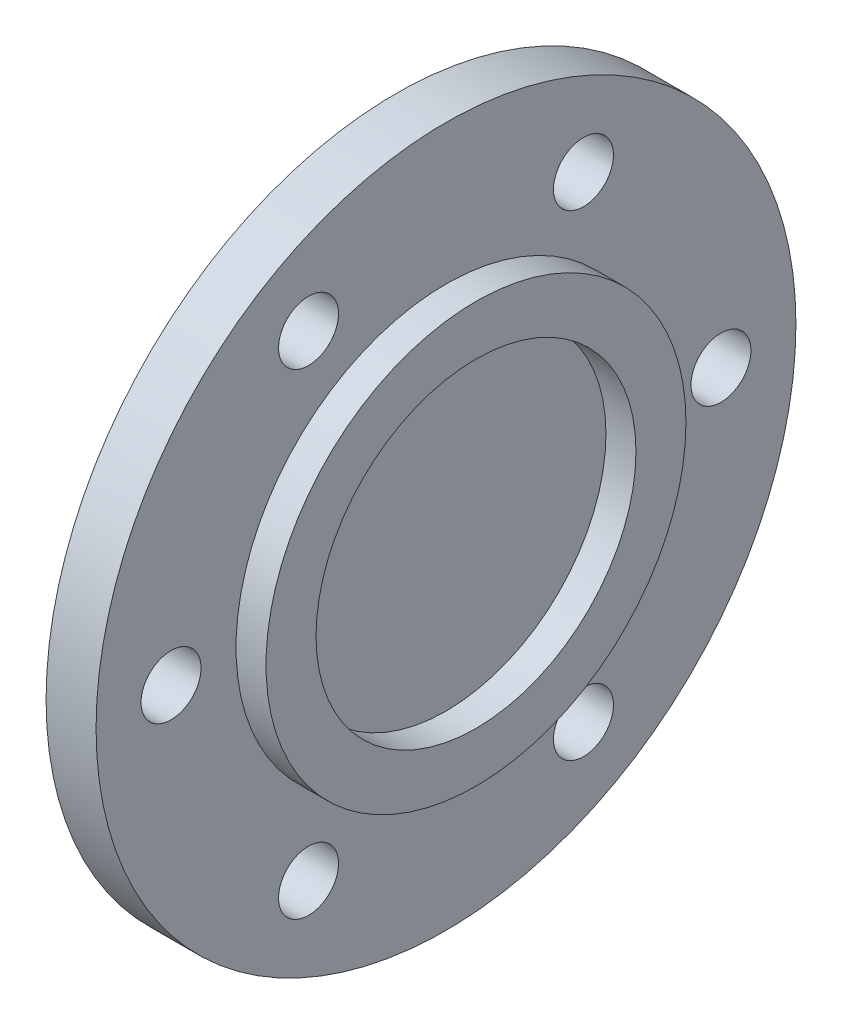
ISO-10303-21;
HEADER;
FILE_DESCRIPTION(('STEP AP214'),'2;1');
FILE_NAME('part.step','',(''),(''),'','','');
FILE_SCHEMA(('AUTOMOTIVE_DESIGN { 1 0 10303 214 1 1 1 1 }'));
ENDSEC;
DATA;
#1=APPLICATION_CONTEXT('core data for automotive mechanical design processes');
#2=APPLICATION_PROTOCOL_DEFINITION('international standard','automotive_design',2000,#1);
#3=PRODUCT_CONTEXT('',#1,'mechanical');
#4=PRODUCT('Part','Part','',(#3));
#5=PRODUCT_RELATED_PRODUCT_CATEGORY('part','',(#4));
#6=PRODUCT_DEFINITION_FORMATION('','',#4);
#7=PRODUCT_DEFINITION_CONTEXT('part definition',#1,'design');
#8=PRODUCT_DEFINITION('design','',#6,#7);
#9=PRODUCT_DEFINITION_SHAPE('','',#8);
#10=(LENGTH_UNIT() NAMED_UNIT(*) SI_UNIT(.MILLI.,.METRE.));
#11=(NAMED_UNIT(*) PLANE_ANGLE_UNIT() SI_UNIT($,.RADIAN.));
#12=(NAMED_UNIT(*) SI_UNIT($,.STERADIAN.) SOLID_ANGLE_UNIT());
#13=UNCERTAINTY_MEASURE_WITH_UNIT(LENGTH_MEASURE(1.E-05),#10,'distance_accuracy_value','');
#14=(GEOMETRIC_REPRESENTATION_CONTEXT(3) GLOBAL_UNCERTAINTY_ASSIGNED_CONTEXT((#13)) GLOBAL_UNIT_ASSIGNED_CONTEXT((#10,
#11,#12)) REPRESENTATION_CONTEXT('',''));
#15=CARTESIAN_POINT('',(0.,0.,0.));
#16=DIRECTION('',(0.,0.,1.));
#17=DIRECTION('',(1.,0.,0.));
#18=AXIS2_PLACEMENT_3D('',#15,#16,#17);
#19=CARTESIAN_POINT('',(0.,0.,0.));
#20=DIRECTION('',(-1.,0.,0.));
#21=DIRECTION('',(0.,0.,1.));
#22=AXIS2_PLACEMENT_3D('',#19,#20,#21);
#23=PLANE('',#22);
#24=CARTESIAN_POINT('',(0.,-23.8156986040719,-13.7500000000003));
#25=DIRECTION('',(-1.,0.,0.));
#26=DIRECTION('',(0.,0.,1.));
#27=AXIS2_PLACEMENT_3D('',#24,#25,#26);
#28=CIRCLE('',#27,3.);
#29=CARTESIAN_POINT('',(0.,-23.8156986040719,-10.7500000000003));
#30=VERTEX_POINT('',#29);
#31=EDGE_CURVE('E76',#30,#30,#28,.T.);
#32=ORIENTED_EDGE('',*,*,#31,.F.);
#33=EDGE_LOOP('',(#32));
#34=FACE_BOUND('',#33,.T.);
#35=CARTESIAN_POINT('',(0.,-23.8156986040722,13.7499999999998));
#36=DIRECTION('',(-1.,0.,0.));
#37=DIRECTION('',(0.,0.,1.));
#38=AXIS2_PLACEMENT_3D('',#35,#36,#37);
#39=CIRCLE('',#38,3.);
#40=CARTESIAN_POINT('',(0.,-23.8156986040722,16.7499999999998));
#41=VERTEX_POINT('',#40);
#42=EDGE_CURVE('E80',#41,#41,#39,.T.);
#43=ORIENTED_EDGE('',*,*,#42,.F.);
#44=EDGE_LOOP('',(#43));
#45=FACE_BOUND('',#44,.T.);
#46=CARTESIAN_POINT('',(0.,0.,27.5));
#47=DIRECTION('',(-1.,0.,0.));
#48=DIRECTION('',(0.,0.,1.));
#49=AXIS2_PLACEMENT_3D('',#46,#47,#48);
#50=CIRCLE('',#49,3.);
#51=CARTESIAN_POINT('',(0.,0.,30.5));
#52=VERTEX_POINT('',#51);
#53=EDGE_CURVE('E84',#52,#52,#50,.T.);
#54=ORIENTED_EDGE('',*,*,#53,.F.);
#55=EDGE_LOOP('',(#54));
#56=FACE_BOUND('',#55,.T.);
#57=CARTESIAN_POINT('',(0.,23.815698604072,13.7500000000001));
#58=DIRECTION('',(-1.,0.,0.));
#59=DIRECTION('',(0.,0.,1.));
#60=AXIS2_PLACEMENT_3D('',#57,#58,#59);
#61=CIRCLE('',#60,3.);
#62=CARTESIAN_POINT('',(0.,23.815698604072,16.7500000000001));
#63=VERTEX_POINT('',#62);
#64=EDGE_CURVE('E88',#63,#63,#61,.T.);
#65=ORIENTED_EDGE('',*,*,#64,.F.);
#66=EDGE_LOOP('',(#65));
#67=FACE_BOUND('',#66,.T.);
#68=CARTESIAN_POINT('',(0.,23.8156986040721,-13.7499999999999));
#69=DIRECTION('',(-1.,0.,0.));
#70=DIRECTION('',(0.,0.,1.));
#71=AXIS2_PLACEMENT_3D('',#68,#69,#70);
#72=CIRCLE('',#71,3.);
#73=CARTESIAN_POINT('',(0.,23.8156986040721,-10.7499999999999));
#74=VERTEX_POINT('',#73);
#75=EDGE_CURVE('E92',#74,#74,#72,.T.);
#76=ORIENTED_EDGE('',*,*,#75,.F.);
#77=EDGE_LOOP('',(#76));
#78=FACE_BOUND('',#77,.T.);
#79=CARTESIAN_POINT('',(0.,0.,-27.5));
#80=DIRECTION('',(-1.,0.,0.));
#81=DIRECTION('',(0.,0.,1.));
#82=AXIS2_PLACEMENT_3D('',#79,#80,#81);
#83=CIRCLE('',#82,3.);
#84=CARTESIAN_POINT('',(0.,0.,-24.5));
#85=VERTEX_POINT('',#84);
#86=EDGE_CURVE('E68',#85,#85,#83,.T.);
#87=ORIENTED_EDGE('',*,*,#86,.F.);
#88=EDGE_LOOP('',(#87));
#89=FACE_BOUND('',#88,.T.);
#90=CARTESIAN_POINT('',(0.,0.,0.));
#91=DIRECTION('',(1.,0.,0.));
#92=DIRECTION('',(0.,0.,-1.));
#93=AXIS2_PLACEMENT_3D('',#90,#91,#92);
#94=CIRCLE('',#93,35.);
#95=CARTESIAN_POINT('',(0.,0.,-35.));
#96=VERTEX_POINT('',#95);
#97=EDGE_CURVE('E10',#96,#96,#94,.T.);
#98=ORIENTED_EDGE('',*,*,#97,.F.);
#99=EDGE_LOOP('',(#98));
#100=FACE_BOUND('',#99,.T.);
#101=ADVANCED_FACE('F37',(#34,#45,#56,#67,#78,#89,#100),#23,.T.);
#102=CARTESIAN_POINT('',(5.,0.,0.));
#103=DIRECTION('',(1.,0.,0.));
#104=DIRECTION('',(0.,0.,-1.));
#105=AXIS2_PLACEMENT_3D('',#102,#103,#104);
#106=CYLINDRICAL_SURFACE('',#105,35.);
#107=ORIENTED_EDGE('',*,*,#97,.T.);
#108=EDGE_LOOP('',(#107));
#109=FACE_BOUND('',#108,.T.);
#110=CARTESIAN_POINT('',(5.,0.,0.));
#111=DIRECTION('',(1.,0.,0.));
#112=DIRECTION('',(0.,0.,-1.));
#113=AXIS2_PLACEMENT_3D('',#110,#111,#112);
#114=CIRCLE('',#113,35.);
#115=CARTESIAN_POINT('',(5.,0.,-35.));
#116=VERTEX_POINT('',#115);
#117=EDGE_CURVE('E44',#116,#116,#114,.T.);
#118=ORIENTED_EDGE('',*,*,#117,.F.);
#119=EDGE_LOOP('',(#118));
#120=FACE_BOUND('',#119,.T.);
#121=ADVANCED_FACE('F123',(#109,#120),#106,.T.);
#122=CARTESIAN_POINT('',(5.,35.,0.));
#123=DIRECTION('',(1.,0.,0.));
#124=DIRECTION('',(0.,0.,-1.));
#125=AXIS2_PLACEMENT_3D('',#122,#123,#124);
#126=PLANE('',#125);
#127=CARTESIAN_POINT('',(5.,-23.8156986040719,-13.7500000000003));
#128=DIRECTION('',(1.,0.,0.));
#129=DIRECTION('',(0.,-0.866025403784433,-0.50000000000001));
#130=AXIS2_PLACEMENT_3D('',#127,#128,#129);
#131=CIRCLE('',#130,3.);
#132=CARTESIAN_POINT('',(5.,-26.4137748154252,-15.2500000000003));
#133=VERTEX_POINT('',#132);
#134=EDGE_CURVE('E101',#133,#133,#131,.T.);
#135=ORIENTED_EDGE('',*,*,#134,.F.);
#136=EDGE_LOOP('',(#135));
#137=FACE_BOUND('',#136,.T.);
#138=CARTESIAN_POINT('',(5.,-23.8156986040722,13.7499999999998));
#139=DIRECTION('',(1.,0.,0.));
#140=DIRECTION('',(0.,-0.866025403784443,0.499999999999992));
#141=AXIS2_PLACEMENT_3D('',#138,#139,#140);
#142=CIRCLE('',#141,3.);
#143=CARTESIAN_POINT('',(5.,-26.4137748154255,15.2499999999998));
#144=VERTEX_POINT('',#143);
#145=EDGE_CURVE('E105',#144,#144,#142,.T.);
#146=ORIENTED_EDGE('',*,*,#145,.F.);
#147=EDGE_LOOP('',(#146));
#148=FACE_BOUND('',#147,.T.);
#149=CARTESIAN_POINT('',(5.,0.,27.5));
#150=DIRECTION('',(1.,0.,0.));
#151=DIRECTION('',(0.,0.,1.));
#152=AXIS2_PLACEMENT_3D('',#149,#150,#151);
#153=CIRCLE('',#152,3.);
#154=CARTESIAN_POINT('',(5.,0.,30.5));
#155=VERTEX_POINT('',#154);
#156=EDGE_CURVE('E109',#155,#155,#153,.T.);
#157=ORIENTED_EDGE('',*,*,#156,.F.);
#158=EDGE_LOOP('',(#157));
#159=FACE_BOUND('',#158,.T.);
#160=CARTESIAN_POINT('',(5.,23.815698604072,13.7500000000001));
#161=DIRECTION('',(1.,0.,0.));
#162=DIRECTION('',(0.,0.866025403784436,0.500000000000004));
#163=AXIS2_PLACEMENT_3D('',#160,#161,#162);
#164=CIRCLE('',#163,3.);
#165=CARTESIAN_POINT('',(5.,26.4137748154253,15.2500000000001));
#166=VERTEX_POINT('',#165);
#167=EDGE_CURVE('E100',#166,#166,#164,.T.);
#168=ORIENTED_EDGE('',*,*,#167,.F.);
#169=EDGE_LOOP('',(#168));
#170=FACE_BOUND('',#169,.T.);
#171=CARTESIAN_POINT('',(5.,23.8156986040721,-13.7499999999999));
#172=DIRECTION('',(1.,0.,0.));
#173=DIRECTION('',(0.,0.86602540378444,-0.499999999999998));
#174=AXIS2_PLACEMENT_3D('',#171,#172,#173);
#175=CIRCLE('',#174,3.);
#176=CARTESIAN_POINT('',(5.,26.4137748154254,-15.2499999999999));
#177=VERTEX_POINT('',#176);
#178=EDGE_CURVE('E96',#177,#177,#175,.T.);
#179=ORIENTED_EDGE('',*,*,#178,.F.);
#180=EDGE_LOOP('',(#179));
#181=FACE_BOUND('',#180,.T.);
#182=CARTESIAN_POINT('',(5.,0.,-27.5));
#183=DIRECTION('',(1.,0.,0.));
#184=DIRECTION('',(0.,0.,-1.));
#185=AXIS2_PLACEMENT_3D('',#182,#183,#184);
#186=CIRCLE('',#185,3.);
#187=CARTESIAN_POINT('',(5.,0.,-30.5));
#188=VERTEX_POINT('',#187);
#189=EDGE_CURVE('E72',#188,#188,#186,.T.);
#190=ORIENTED_EDGE('',*,*,#189,.F.);
#191=EDGE_LOOP('',(#190));
#192=FACE_BOUND('',#191,.T.);
#193=ORIENTED_EDGE('',*,*,#117,.T.);
#194=EDGE_LOOP('',(#193));
#195=FACE_BOUND('',#194,.T.);
#196=CARTESIAN_POINT('',(5.,0.,0.));
#197=DIRECTION('',(1.,0.,0.));
#198=DIRECTION('',(0.,0.,-1.));
#199=AXIS2_PLACEMENT_3D('',#196,#197,#198);
#200=CIRCLE('',#199,21.);
#201=CARTESIAN_POINT('',(5.,0.,-21.));
#202=VERTEX_POINT('',#201);
#203=EDGE_CURVE('E49',#202,#202,#200,.T.);
#204=ORIENTED_EDGE('',*,*,#203,.F.);
#205=EDGE_LOOP('',(#204));
#206=FACE_BOUND('',#205,.T.);
#207=ADVANCED_FACE('F119',(#137,#148,#159,#170,#181,#192,#195,#206),#126,.T.);
#208=CARTESIAN_POINT('',(5.,0.,0.));
#209=DIRECTION('',(1.,0.,0.));
#210=DIRECTION('',(0.,0.,-1.));
#211=AXIS2_PLACEMENT_3D('',#208,#209,#210);
#212=CYLINDRICAL_SURFACE('',#211,21.);
#213=ORIENTED_EDGE('',*,*,#203,.T.);
#214=EDGE_LOOP('',(#213));
#215=FACE_BOUND('',#214,.T.);
#216=CARTESIAN_POINT('',(8.,0.,0.));
#217=DIRECTION('',(1.,0.,0.));
#218=DIRECTION('',(0.,0.,-1.));
#219=AXIS2_PLACEMENT_3D('',#216,#217,#218);
#220=CIRCLE('',#219,21.);
#221=CARTESIAN_POINT('',(8.,0.,-21.));
#222=VERTEX_POINT('',#221);
#223=EDGE_CURVE('E54',#222,#222,#220,.T.);
#224=ORIENTED_EDGE('',*,*,#223,.F.);
#225=EDGE_LOOP('',(#224));
#226=FACE_BOUND('',#225,.T.);
#227=ADVANCED_FACE('F122',(#215,#226),#212,.T.);
#228=CARTESIAN_POINT('',(8.,21.,0.));
#229=DIRECTION('',(1.,0.,0.));
#230=DIRECTION('',(0.,0.,-1.));
#231=AXIS2_PLACEMENT_3D('',#228,#229,#230);
#232=PLANE('',#231);
#233=ORIENTED_EDGE('',*,*,#223,.T.);
#234=EDGE_LOOP('',(#233));
#235=FACE_BOUND('',#234,.T.);
#236=CARTESIAN_POINT('',(8.,0.,0.));
#237=DIRECTION('',(1.,0.,0.));
#238=DIRECTION('',(0.,0.,-1.));
#239=AXIS2_PLACEMENT_3D('',#236,#237,#238);
#240=CIRCLE('',#239,16.);
#241=CARTESIAN_POINT('',(8.,0.,-16.));
#242=VERTEX_POINT('',#241);
#243=EDGE_CURVE('E60',#242,#242,#240,.T.);
#244=ORIENTED_EDGE('',*,*,#243,.F.);
#245=EDGE_LOOP('',(#244));
#246=FACE_BOUND('',#245,.T.);
#247=ADVANCED_FACE('F134',(#235,#246),#232,.T.);
#248=CARTESIAN_POINT('',(5.,0.,0.));
#249=DIRECTION('',(1.,0.,0.));
#250=DIRECTION('',(0.,0.,-1.));
#251=AXIS2_PLACEMENT_3D('',#248,#249,#250);
#252=CYLINDRICAL_SURFACE('',#251,16.);
#253=ORIENTED_EDGE('',*,*,#243,.T.);
#254=EDGE_LOOP('',(#253));
#255=FACE_BOUND('',#254,.T.);
#256=CARTESIAN_POINT('',(5.,0.,0.));
#257=DIRECTION('',(1.,0.,0.));
#258=DIRECTION('',(0.,0.,-1.));
#259=AXIS2_PLACEMENT_3D('',#256,#257,#258);
#260=CIRCLE('',#259,16.);
#261=CARTESIAN_POINT('',(5.,0.,-16.));
#262=VERTEX_POINT('',#261);
#263=EDGE_CURVE('E64',#262,#262,#260,.T.);
#264=ORIENTED_EDGE('',*,*,#263,.F.);
#265=EDGE_LOOP('',(#264));
#266=FACE_BOUND('',#265,.T.);
#267=ADVANCED_FACE('F140',(#255,#266),#252,.F.);
#268=CARTESIAN_POINT('',(5.,16.,0.));
#269=DIRECTION('',(1.,0.,0.));
#270=DIRECTION('',(0.,0.,-1.));
#271=AXIS2_PLACEMENT_3D('',#268,#269,#270);
#272=PLANE('',#271);
#273=ORIENTED_EDGE('',*,*,#263,.T.);
#274=EDGE_LOOP('',(#273));
#275=FACE_BOUND('',#274,.T.);
#276=ADVANCED_FACE('F146',(#275),#272,.T.);
#277=CARTESIAN_POINT('',(-5.,0.,-27.5));
#278=DIRECTION('',(1.,0.,0.));
#279=DIRECTION('',(0.,0.,-1.));
#280=AXIS2_PLACEMENT_3D('',#277,#278,#279);
#281=CYLINDRICAL_SURFACE('',#280,3.);
#282=ORIENTED_EDGE('',*,*,#86,.T.);
#283=EDGE_LOOP('',(#282));
#284=FACE_BOUND('',#283,.T.);
#285=ORIENTED_EDGE('',*,*,#189,.T.);
#286=EDGE_LOOP('',(#285));
#287=FACE_BOUND('',#286,.T.);
#288=ADVANCED_FACE('F151',(#284,#287),#281,.F.);
#289=CARTESIAN_POINT('',(-5.,23.8156986040721,-13.7499999999999));
#290=DIRECTION('',(1.,0.,0.));
#291=DIRECTION('',(0.,0.,-1.));
#292=AXIS2_PLACEMENT_3D('',#289,#290,#291);
#293=CYLINDRICAL_SURFACE('',#292,3.);
#294=ORIENTED_EDGE('',*,*,#75,.T.);
#295=EDGE_LOOP('',(#294));
#296=FACE_BOUND('',#295,.T.);
#297=ORIENTED_EDGE('',*,*,#178,.T.);
#298=EDGE_LOOP('',(#297));
#299=FACE_BOUND('',#298,.T.);
#300=ADVANCED_FACE('F156',(#296,#299),#293,.F.);
#301=CARTESIAN_POINT('',(-5.,23.815698604072,13.7500000000001));
#302=DIRECTION('',(1.,0.,0.));
#303=DIRECTION('',(0.,0.,-1.));
#304=AXIS2_PLACEMENT_3D('',#301,#302,#303);
#305=CYLINDRICAL_SURFACE('',#304,3.);
#306=ORIENTED_EDGE('',*,*,#64,.T.);
#307=EDGE_LOOP('',(#306));
#308=FACE_BOUND('',#307,.T.);
#309=ORIENTED_EDGE('',*,*,#167,.T.);
#310=EDGE_LOOP('',(#309));
#311=FACE_BOUND('',#310,.T.);
#312=ADVANCED_FACE('F117',(#308,#311),#305,.F.);
#313=CARTESIAN_POINT('',(-5.,0.,27.5));
#314=DIRECTION('',(1.,0.,0.));
#315=DIRECTION('',(0.,0.,-1.));
#316=AXIS2_PLACEMENT_3D('',#313,#314,#315);
#317=CYLINDRICAL_SURFACE('',#316,3.);
#318=ORIENTED_EDGE('',*,*,#53,.T.);
#319=EDGE_LOOP('',(#318));
#320=FACE_BOUND('',#319,.T.);
#321=ORIENTED_EDGE('',*,*,#156,.T.);
#322=EDGE_LOOP('',(#321));
#323=FACE_BOUND('',#322,.T.);
#324=ADVANCED_FACE('F184',(#320,#323),#317,.F.);
#325=CARTESIAN_POINT('',(-5.,-23.8156986040722,13.7499999999998));
#326=DIRECTION('',(1.,0.,0.));
#327=DIRECTION('',(0.,0.,-1.));
#328=AXIS2_PLACEMENT_3D('',#325,#326,#327);
#329=CYLINDRICAL_SURFACE('',#328,3.);
#330=ORIENTED_EDGE('',*,*,#42,.T.);
#331=EDGE_LOOP('',(#330));
#332=FACE_BOUND('',#331,.T.);
#333=ORIENTED_EDGE('',*,*,#145,.T.);
#334=EDGE_LOOP('',(#333));
#335=FACE_BOUND('',#334,.T.);
#336=ADVANCED_FACE('F191',(#332,#335),#329,.F.);
#337=CARTESIAN_POINT('',(-5.,-23.8156986040719,-13.7500000000003));
#338=DIRECTION('',(1.,0.,0.));
#339=DIRECTION('',(0.,0.,-1.));
#340=AXIS2_PLACEMENT_3D('',#337,#338,#339);
#341=CYLINDRICAL_SURFACE('',#340,3.);
#342=ORIENTED_EDGE('',*,*,#31,.T.);
#343=EDGE_LOOP('',(#342));
#344=FACE_BOUND('',#343,.T.);
#345=ORIENTED_EDGE('',*,*,#134,.T.);
#346=EDGE_LOOP('',(#345));
#347=FACE_BOUND('',#346,.T.);
#348=ADVANCED_FACE('F188',(#344,#347),#341,.F.);
#349=CLOSED_SHELL('',(#101,#121,#207,#227,#247,#267,#276,#288,#300,#312,#324,#336,#348));
#350=MANIFOLD_SOLID_BREP('B2',#349);
#351=ADVANCED_BREP_SHAPE_REPRESENTATION('',(#18,#350),#14);
#352=SHAPE_DEFINITION_REPRESENTATION(#9,#351);
ENDSEC;
END-ISO-10303-21;
